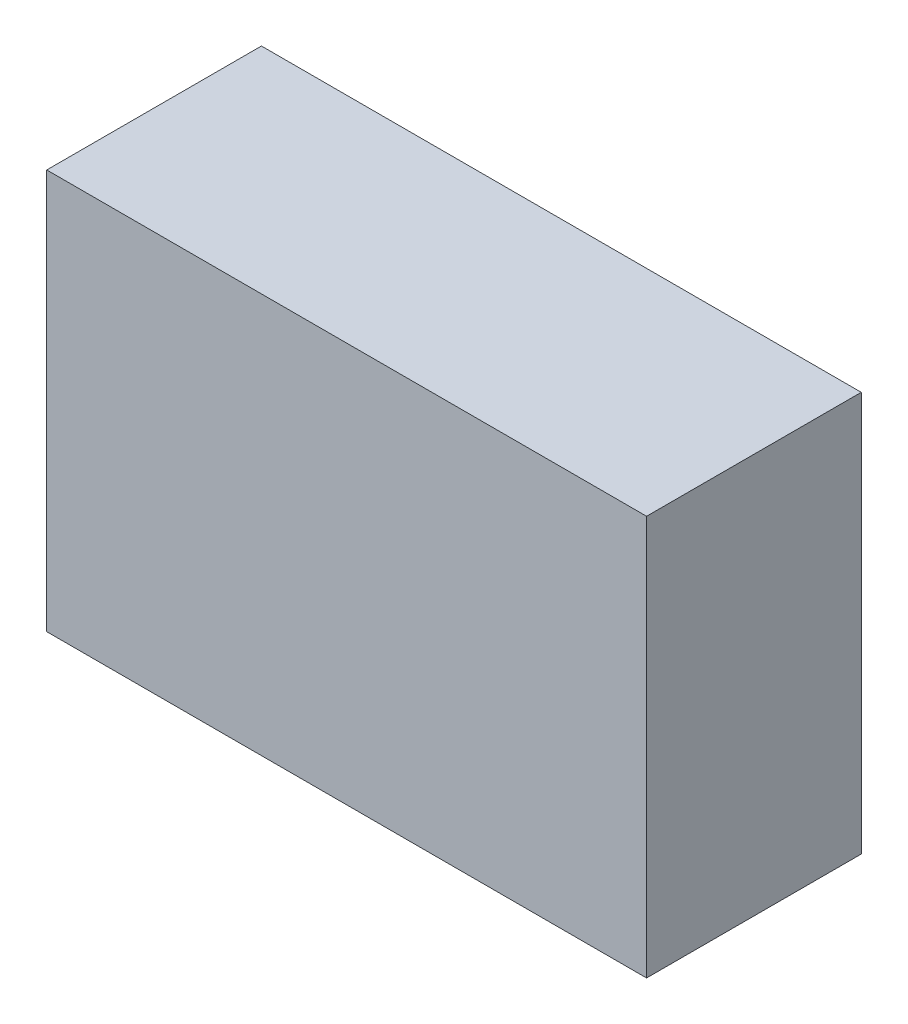
ISO-10303-21;
HEADER;
FILE_DESCRIPTION(('STEP AP214'),'2;1');
FILE_NAME('part.step','',(''),(''),'','','');
FILE_SCHEMA(('AUTOMOTIVE_DESIGN { 1 0 10303 214 1 1 1 1 }'));
ENDSEC;
DATA;
#1=APPLICATION_CONTEXT('core data for automotive mechanical design processes');
#2=APPLICATION_PROTOCOL_DEFINITION('international standard','automotive_design',2000,#1);
#3=PRODUCT_CONTEXT('',#1,'mechanical');
#4=PRODUCT('Part','Part','',(#3));
#5=PRODUCT_RELATED_PRODUCT_CATEGORY('part','',(#4));
#6=PRODUCT_DEFINITION_FORMATION('','',#4);
#7=PRODUCT_DEFINITION_CONTEXT('part definition',#1,'design');
#8=PRODUCT_DEFINITION('design','',#6,#7);
#9=PRODUCT_DEFINITION_SHAPE('','',#8);
#10=(LENGTH_UNIT() NAMED_UNIT(*) SI_UNIT(.MILLI.,.METRE.));
#11=(NAMED_UNIT(*) PLANE_ANGLE_UNIT() SI_UNIT($,.RADIAN.));
#12=(NAMED_UNIT(*) SI_UNIT($,.STERADIAN.) SOLID_ANGLE_UNIT());
#13=UNCERTAINTY_MEASURE_WITH_UNIT(LENGTH_MEASURE(1.E-05),#10,'distance_accuracy_value','');
#14=(GEOMETRIC_REPRESENTATION_CONTEXT(3) GLOBAL_UNCERTAINTY_ASSIGNED_CONTEXT((#13)) GLOBAL_UNIT_ASSIGNED_CONTEXT((#10,
#11,#12)) REPRESENTATION_CONTEXT('',''));
#15=CARTESIAN_POINT('',(0.,0.,0.));
#16=DIRECTION('',(0.,0.,1.));
#17=DIRECTION('',(1.,0.,0.));
#18=AXIS2_PLACEMENT_3D('',#15,#16,#17);
#19=CARTESIAN_POINT('',(0.,0.,0.2999994));
#20=DIRECTION('',(0.,0.,1.));
#21=DIRECTION('',(1.,0.,0.));
#22=AXIS2_PLACEMENT_3D('',#19,#20,#21);
#23=PLANE('',#22);
#24=DIRECTION('',(0.,1.,0.));
#25=VECTOR('',#24,1.);
#26=CARTESIAN_POINT('',(0.4191,-0.2794,0.2999994));
#27=LINE('',#26,#25);
#28=CARTESIAN_POINT('',(0.4191,-0.2794,0.2999994));
#29=VERTEX_POINT('',#28);
#30=CARTESIAN_POINT('',(0.4191,0.2794,0.2999994));
#31=VERTEX_POINT('',#30);
#32=EDGE_CURVE('E96',#29,#31,#27,.T.);
#33=ORIENTED_EDGE('',*,*,#32,.T.);
#34=DIRECTION('',(-1.,0.,0.));
#35=VECTOR('',#34,1.);
#36=CARTESIAN_POINT('',(0.4191,0.2794,0.2999994));
#37=LINE('',#36,#35);
#38=CARTESIAN_POINT('',(-0.4191,0.2794,0.2999994));
#39=VERTEX_POINT('',#38);
#40=EDGE_CURVE('E79',#31,#39,#37,.T.);
#41=ORIENTED_EDGE('',*,*,#40,.T.);
#42=DIRECTION('',(0.,-1.,0.));
#43=VECTOR('',#42,1.);
#44=CARTESIAN_POINT('',(-0.4191,0.2794,0.2999994));
#45=LINE('',#44,#43);
#46=CARTESIAN_POINT('',(-0.4191,-0.2794,0.2999994));
#47=VERTEX_POINT('',#46);
#48=EDGE_CURVE('E20',#39,#47,#45,.T.);
#49=ORIENTED_EDGE('',*,*,#48,.T.);
#50=DIRECTION('',(1.,0.,0.));
#51=VECTOR('',#50,1.);
#52=CARTESIAN_POINT('',(-0.4191,-0.2794,0.2999994));
#53=LINE('',#52,#51);
#54=EDGE_CURVE('E11',#47,#29,#53,.T.);
#55=ORIENTED_EDGE('',*,*,#54,.T.);
#56=EDGE_LOOP('',(#33,#41,#49,#55));
#57=FACE_BOUND('',#56,.T.);
#58=ADVANCED_FACE('F17',(#57),#23,.T.);
#59=CARTESIAN_POINT('',(0.,0.,0.));
#60=DIRECTION('',(0.,0.,1.));
#61=DIRECTION('',(1.,0.,0.));
#62=AXIS2_PLACEMENT_3D('',#59,#60,#61);
#63=PLANE('',#62);
#64=DIRECTION('',(1.,0.,0.));
#65=VECTOR('',#64,1.);
#66=CARTESIAN_POINT('',(-0.4191,-0.2794,0.));
#67=LINE('',#66,#65);
#68=CARTESIAN_POINT('',(-0.4191,-0.2794,0.));
#69=VERTEX_POINT('',#68);
#70=CARTESIAN_POINT('',(0.4191,-0.2794,0.));
#71=VERTEX_POINT('',#70);
#72=EDGE_CURVE('E27',#69,#71,#67,.T.);
#73=ORIENTED_EDGE('',*,*,#72,.F.);
#74=DIRECTION('',(0.,-1.,0.));
#75=VECTOR('',#74,1.);
#76=CARTESIAN_POINT('',(-0.4191,0.2794,0.));
#77=LINE('',#76,#75);
#78=CARTESIAN_POINT('',(-0.4191,0.2794,0.));
#79=VERTEX_POINT('',#78);
#80=EDGE_CURVE('E70',#79,#69,#77,.T.);
#81=ORIENTED_EDGE('',*,*,#80,.F.);
#82=DIRECTION('',(-1.,0.,0.));
#83=VECTOR('',#82,1.);
#84=CARTESIAN_POINT('',(0.4191,0.2794,0.));
#85=LINE('',#84,#83);
#86=CARTESIAN_POINT('',(0.4191,0.2794,0.));
#87=VERTEX_POINT('',#86);
#88=EDGE_CURVE('E74',#87,#79,#85,.T.);
#89=ORIENTED_EDGE('',*,*,#88,.F.);
#90=DIRECTION('',(0.,1.,0.));
#91=VECTOR('',#90,1.);
#92=CARTESIAN_POINT('',(0.4191,-0.2794,0.));
#93=LINE('',#92,#91);
#94=EDGE_CURVE('E110',#71,#87,#93,.T.);
#95=ORIENTED_EDGE('',*,*,#94,.F.);
#96=EDGE_LOOP('',(#73,#81,#89,#95));
#97=FACE_BOUND('',#96,.T.);
#98=ADVANCED_FACE('F71',(#97),#63,.F.);
#99=CARTESIAN_POINT('',(-0.4191,-0.2794,0.));
#100=DIRECTION('',(0.,1.,0.));
#101=DIRECTION('',(1.,0.,0.));
#102=AXIS2_PLACEMENT_3D('',#99,#100,#101);
#103=PLANE('',#102);
#104=ORIENTED_EDGE('',*,*,#72,.T.);
#105=DIRECTION('',(0.,0.,1.));
#106=VECTOR('',#105,1.);
#107=CARTESIAN_POINT('',(0.4191,-0.2794,0.));
#108=LINE('',#107,#106);
#109=EDGE_CURVE('E91',#71,#29,#108,.T.);
#110=ORIENTED_EDGE('',*,*,#109,.T.);
#111=ORIENTED_EDGE('',*,*,#54,.F.);
#112=DIRECTION('',(0.,0.,1.));
#113=VECTOR('',#112,1.);
#114=CARTESIAN_POINT('',(-0.4191,-0.2794,0.));
#115=LINE('',#114,#113);
#116=EDGE_CURVE('E78',#69,#47,#115,.T.);
#117=ORIENTED_EDGE('',*,*,#116,.F.);
#118=EDGE_LOOP('',(#104,#110,#111,#117));
#119=FACE_BOUND('',#118,.T.);
#120=ADVANCED_FACE('F145',(#119),#103,.F.);
#121=CARTESIAN_POINT('',(-0.4191,0.2794,0.));
#122=DIRECTION('',(1.,0.,0.));
#123=DIRECTION('',(0.,1.,0.));
#124=AXIS2_PLACEMENT_3D('',#121,#122,#123);
#125=PLANE('',#124);
#126=ORIENTED_EDGE('',*,*,#80,.T.);
#127=ORIENTED_EDGE('',*,*,#116,.T.);
#128=ORIENTED_EDGE('',*,*,#48,.F.);
#129=DIRECTION('',(0.,0.,1.));
#130=VECTOR('',#129,1.);
#131=CARTESIAN_POINT('',(-0.4191,0.2794,0.));
#132=LINE('',#131,#130);
#133=EDGE_CURVE('E81',#79,#39,#132,.T.);
#134=ORIENTED_EDGE('',*,*,#133,.F.);
#135=EDGE_LOOP('',(#126,#127,#128,#134));
#136=FACE_BOUND('',#135,.T.);
#137=ADVANCED_FACE('F82',(#136),#125,.F.);
#138=CARTESIAN_POINT('',(0.4191,0.2794,0.));
#139=DIRECTION('',(0.,-1.,0.));
#140=DIRECTION('',(0.,0.,-1.));
#141=AXIS2_PLACEMENT_3D('',#138,#139,#140);
#142=PLANE('',#141);
#143=ORIENTED_EDGE('',*,*,#88,.T.);
#144=ORIENTED_EDGE('',*,*,#133,.T.);
#145=ORIENTED_EDGE('',*,*,#40,.F.);
#146=DIRECTION('',(0.,0.,1.));
#147=VECTOR('',#146,1.);
#148=CARTESIAN_POINT('',(0.4191,0.2794,0.));
#149=LINE('',#148,#147);
#150=EDGE_CURVE('E88',#87,#31,#149,.T.);
#151=ORIENTED_EDGE('',*,*,#150,.F.);
#152=EDGE_LOOP('',(#143,#144,#145,#151));
#153=FACE_BOUND('',#152,.T.);
#154=ADVANCED_FACE('F86',(#153),#142,.F.);
#155=CARTESIAN_POINT('',(0.4191,-0.2794,0.));
#156=DIRECTION('',(-1.,0.,0.));
#157=DIRECTION('',(0.,0.,1.));
#158=AXIS2_PLACEMENT_3D('',#155,#156,#157);
#159=PLANE('',#158);
#160=ORIENTED_EDGE('',*,*,#94,.T.);
#161=ORIENTED_EDGE('',*,*,#150,.T.);
#162=ORIENTED_EDGE('',*,*,#32,.F.);
#163=ORIENTED_EDGE('',*,*,#109,.F.);
#164=EDGE_LOOP('',(#160,#161,#162,#163));
#165=FACE_BOUND('',#164,.T.);
#166=ADVANCED_FACE('F109',(#165),#159,.F.);
#167=CLOSED_SHELL('',(#58,#98,#120,#137,#154,#166));
#168=MANIFOLD_SOLID_BREP('B1',#167);
#169=ADVANCED_BREP_SHAPE_REPRESENTATION('',(#18,#168),#14);
#170=SHAPE_DEFINITION_REPRESENTATION(#9,#169);
ENDSEC;
END-ISO-10303-21;
